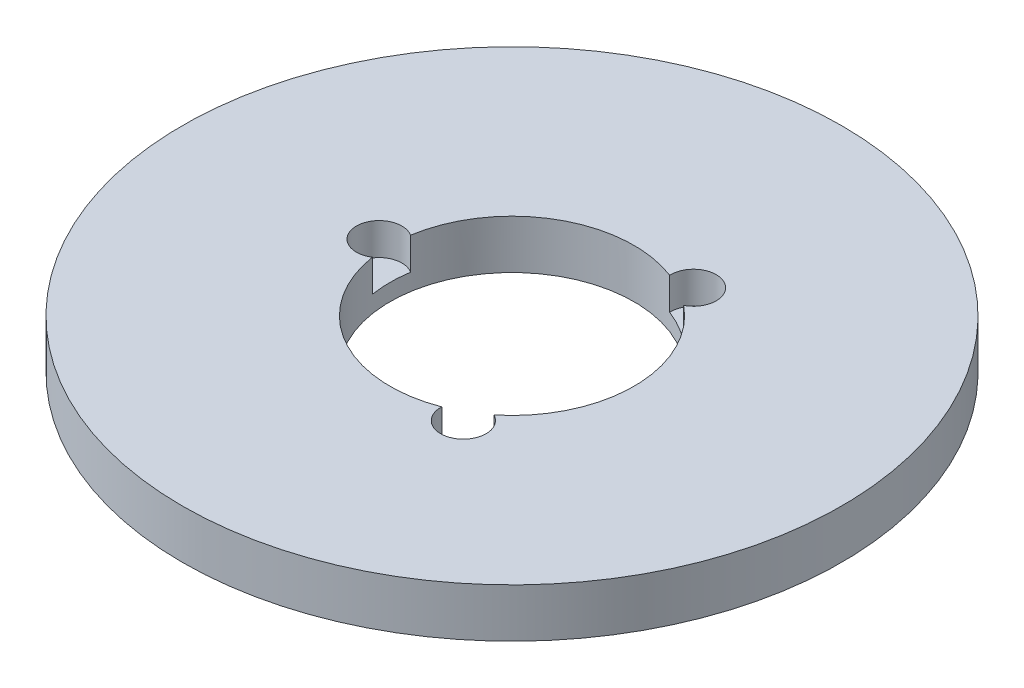
ISO-10303-21;
HEADER;
FILE_DESCRIPTION(('STEP AP214'),'2;1');
FILE_NAME('part.step','',(''),(''),'','','');
FILE_SCHEMA(('AUTOMOTIVE_DESIGN { 1 0 10303 214 1 1 1 1 }'));
ENDSEC;
DATA;
#1=APPLICATION_CONTEXT('core data for automotive mechanical design processes');
#2=APPLICATION_PROTOCOL_DEFINITION('international standard','automotive_design',2000,#1);
#3=PRODUCT_CONTEXT('',#1,'mechanical');
#4=PRODUCT('Part','Part','',(#3));
#5=PRODUCT_RELATED_PRODUCT_CATEGORY('part','',(#4));
#6=PRODUCT_DEFINITION_FORMATION('','',#4);
#7=PRODUCT_DEFINITION_CONTEXT('part definition',#1,'design');
#8=PRODUCT_DEFINITION('design','',#6,#7);
#9=PRODUCT_DEFINITION_SHAPE('','',#8);
#10=(LENGTH_UNIT() NAMED_UNIT(*) SI_UNIT(.MILLI.,.METRE.));
#11=(NAMED_UNIT(*) PLANE_ANGLE_UNIT() SI_UNIT($,.RADIAN.));
#12=(NAMED_UNIT(*) SI_UNIT($,.STERADIAN.) SOLID_ANGLE_UNIT());
#13=UNCERTAINTY_MEASURE_WITH_UNIT(LENGTH_MEASURE(1.E-05),#10,'distance_accuracy_value','');
#14=(GEOMETRIC_REPRESENTATION_CONTEXT(3) GLOBAL_UNCERTAINTY_ASSIGNED_CONTEXT((#13)) GLOBAL_UNIT_ASSIGNED_CONTEXT((#10,
#11,#12)) REPRESENTATION_CONTEXT('',''));
#15=CARTESIAN_POINT('',(0.,0.,0.));
#16=DIRECTION('',(0.,0.,1.));
#17=DIRECTION('',(1.,0.,0.));
#18=AXIS2_PLACEMENT_3D('',#15,#16,#17);
#19=CARTESIAN_POINT('',(0.,10.,0.));
#20=DIRECTION('',(0.,-1.,0.));
#21=DIRECTION('',(0.,0.,-1.));
#22=AXIS2_PLACEMENT_3D('',#19,#20,#21);
#23=CYLINDRICAL_SURFACE('',#22,67.5);
#24=CARTESIAN_POINT('',(0.,10.,0.));
#25=DIRECTION('',(0.,1.,0.));
#26=DIRECTION('',(0.,0.,1.));
#27=AXIS2_PLACEMENT_3D('',#24,#25,#26);
#28=CIRCLE('',#27,67.5);
#29=CARTESIAN_POINT('',(0.,10.,67.5));
#30=VERTEX_POINT('',#29);
#31=EDGE_CURVE('E126',#30,#30,#28,.T.);
#32=ORIENTED_EDGE('',*,*,#31,.F.);
#33=EDGE_LOOP('',(#32));
#34=FACE_BOUND('',#33,.T.);
#35=CARTESIAN_POINT('',(0.,0.,0.));
#36=DIRECTION('',(0.,1.,0.));
#37=DIRECTION('',(0.,0.,1.));
#38=AXIS2_PLACEMENT_3D('',#35,#36,#37);
#39=CIRCLE('',#38,67.5);
#40=CARTESIAN_POINT('',(0.,0.,67.5));
#41=VERTEX_POINT('',#40);
#42=EDGE_CURVE('E124',#41,#41,#39,.T.);
#43=ORIENTED_EDGE('',*,*,#42,.T.);
#44=EDGE_LOOP('',(#43));
#45=FACE_BOUND('',#44,.T.);
#46=ADVANCED_FACE('F39',(#34,#45),#23,.T.);
#47=CARTESIAN_POINT('',(0.,10.,0.));
#48=DIRECTION('',(0.,1.,0.));
#49=DIRECTION('',(0.,0.,1.));
#50=AXIS2_PLACEMENT_3D('',#47,#48,#49);
#51=PLANE('',#50);
#52=CARTESIAN_POINT('',(13.6070457408787,10.,23.5680945641154));
#53=DIRECTION('',(0.,1.,0.));
#54=DIRECTION('',(0.866025403784436,0.,-0.500000000000004));
#55=AXIS2_PLACEMENT_3D('',#52,#53,#54);
#56=CIRCLE('',#55,4.65427887099612);
#57=CARTESIAN_POINT('',(8.95836776458697,10.,23.3398296265078));
#58=VERTEX_POINT('',#57);
#59=CARTESIAN_POINT('',(15.7337014942631,10.,19.4280888738297));
#60=VERTEX_POINT('',#59);
#61=EDGE_CURVE('E147',#58,#60,#56,.T.);
#62=ORIENTED_EDGE('',*,*,#61,.F.);
#63=CARTESIAN_POINT('',(0.,10.,0.));
#64=DIRECTION('',(0.,1.,0.));
#65=DIRECTION('',(0.,0.,1.));
#66=AXIS2_PLACEMENT_3D('',#63,#64,#65);
#67=CIRCLE('',#66,25.);
#68=CARTESIAN_POINT('',(-24.6920692588498,10.,3.91174075267806));
#69=VERTEX_POINT('',#68);
#70=EDGE_CURVE('E118',#69,#58,#67,.T.);
#71=ORIENTED_EDGE('',*,*,#70,.F.);
#72=CARTESIAN_POINT('',(-27.2140914817572,10.,0.));
#73=DIRECTION('',(0.,1.,0.));
#74=DIRECTION('',(0.,0.,1.));
#75=AXIS2_PLACEMENT_3D('',#72,#73,#74);
#76=CIRCLE('',#75,4.65427887099612);
#77=CARTESIAN_POINT('',(-24.6920692588498,10.,-3.91174075267806));
#78=VERTEX_POINT('',#77);
#79=EDGE_CURVE('E113',#78,#69,#76,.T.);
#80=ORIENTED_EDGE('',*,*,#79,.F.);
#81=CARTESIAN_POINT('',(8.95836776458664,10.,-23.3398296265079));
#82=VERTEX_POINT('',#81);
#83=EDGE_CURVE('E106',#82,#78,#67,.T.);
#84=ORIENTED_EDGE('',*,*,#83,.F.);
#85=CARTESIAN_POINT('',(13.6070457408784,10.,-23.5680945641156));
#86=DIRECTION('',(0.,1.,0.));
#87=DIRECTION('',(-0.866025403784443,0.,-0.499999999999992));
#88=AXIS2_PLACEMENT_3D('',#85,#86,#87);
#89=CIRCLE('',#88,4.65427887099612);
#90=CARTESIAN_POINT('',(15.7337014942628,10.,-19.4280888738299));
#91=VERTEX_POINT('',#90);
#92=EDGE_CURVE('E90',#91,#82,#89,.T.);
#93=ORIENTED_EDGE('',*,*,#92,.F.);
#94=EDGE_CURVE('E116',#60,#91,#67,.T.);
#95=ORIENTED_EDGE('',*,*,#94,.F.);
#96=EDGE_LOOP('',(#62,#71,#80,#84,#93,#95));
#97=FACE_BOUND('',#96,.T.);
#98=ORIENTED_EDGE('',*,*,#31,.T.);
#99=EDGE_LOOP('',(#98));
#100=FACE_BOUND('',#99,.T.);
#101=ADVANCED_FACE('F115',(#97,#100),#51,.T.);
#102=CARTESIAN_POINT('',(0.,0.,0.));
#103=DIRECTION('',(0.,1.,0.));
#104=DIRECTION('',(0.,0.,1.));
#105=AXIS2_PLACEMENT_3D('',#102,#103,#104);
#106=PLANE('',#105);
#107=CARTESIAN_POINT('',(0.,0.,0.));
#108=DIRECTION('',(0.,1.,0.));
#109=DIRECTION('',(0.,0.,1.));
#110=AXIS2_PLACEMENT_3D('',#107,#108,#109);
#111=CIRCLE('',#110,25.);
#112=CARTESIAN_POINT('',(0.,0.,25.));
#113=VERTEX_POINT('',#112);
#114=EDGE_CURVE('E120',#113,#113,#111,.T.);
#115=ORIENTED_EDGE('',*,*,#114,.T.);
#116=EDGE_LOOP('',(#115));
#117=FACE_BOUND('',#116,.T.);
#118=ORIENTED_EDGE('',*,*,#42,.F.);
#119=EDGE_LOOP('',(#118));
#120=FACE_BOUND('',#119,.T.);
#121=ADVANCED_FACE('F164',(#117,#120),#106,.F.);
#122=CARTESIAN_POINT('',(0.,10.,0.));
#123=DIRECTION('',(0.,-1.,0.));
#124=DIRECTION('',(0.,0.,-1.));
#125=AXIS2_PLACEMENT_3D('',#122,#123,#124);
#126=CYLINDRICAL_SURFACE('',#125,25.);
#127=DIRECTION('',(0.,1.,0.));
#128=VECTOR('',#127,1.);
#129=CARTESIAN_POINT('',(8.95836776458697,6.71700690239391,23.3398296265078));
#130=LINE('',#129,#128);
#131=CARTESIAN_POINT('',(8.95836776458697,3.43401380478783,23.3398296265078));
#132=VERTEX_POINT('',#131);
#133=EDGE_CURVE('E11',#132,#58,#130,.T.);
#134=ORIENTED_EDGE('',*,*,#133,.F.);
#135=CARTESIAN_POINT('',(0.,3.43401380478783,0.));
#136=DIRECTION('',(0.,1.,0.));
#137=DIRECTION('',(0.,0.,1.));
#138=AXIS2_PLACEMENT_3D('',#135,#136,#137);
#139=CIRCLE('',#138,25.);
#140=CARTESIAN_POINT('',(15.7337014942631,3.43401380478783,19.4280888738297));
#141=VERTEX_POINT('',#140);
#142=EDGE_CURVE('E144',#132,#141,#139,.T.);
#143=ORIENTED_EDGE('',*,*,#142,.T.);
#144=DIRECTION('',(0.,1.,0.));
#145=VECTOR('',#144,1.);
#146=CARTESIAN_POINT('',(15.7337014942631,6.71700690239391,19.4280888738297));
#147=LINE('',#146,#145);
#148=EDGE_CURVE('E46',#60,#141,#147,.F.);
#149=ORIENTED_EDGE('',*,*,#148,.F.);
#150=ORIENTED_EDGE('',*,*,#94,.T.);
#151=DIRECTION('',(0.,1.,0.));
#152=VECTOR('',#151,1.);
#153=CARTESIAN_POINT('',(15.7337014942628,6.71700690239391,-19.4280888738299));
#154=LINE('',#153,#152);
#155=CARTESIAN_POINT('',(15.7337014942628,3.43401380478783,-19.4280888738299));
#156=VERTEX_POINT('',#155);
#157=EDGE_CURVE('E92',#156,#91,#154,.T.);
#158=ORIENTED_EDGE('',*,*,#157,.F.);
#159=CARTESIAN_POINT('',(0.,3.43401380478783,0.));
#160=DIRECTION('',(0.,1.,0.));
#161=DIRECTION('',(0.,0.,1.));
#162=AXIS2_PLACEMENT_3D('',#159,#160,#161);
#163=CIRCLE('',#162,25.);
#164=CARTESIAN_POINT('',(8.95836776458664,3.43401380478783,-23.3398296265079));
#165=VERTEX_POINT('',#164);
#166=EDGE_CURVE('E107',#156,#165,#163,.T.);
#167=ORIENTED_EDGE('',*,*,#166,.T.);
#168=DIRECTION('',(0.,1.,0.));
#169=VECTOR('',#168,1.);
#170=CARTESIAN_POINT('',(8.95836776458664,6.71700690239391,-23.3398296265079));
#171=LINE('',#170,#169);
#172=EDGE_CURVE('E95',#82,#165,#171,.F.);
#173=ORIENTED_EDGE('',*,*,#172,.F.);
#174=ORIENTED_EDGE('',*,*,#83,.T.);
#175=DIRECTION('',(0.,1.,0.));
#176=VECTOR('',#175,1.);
#177=CARTESIAN_POINT('',(-24.6920692588499,6.71700690239391,-3.91174075267807));
#178=LINE('',#177,#176);
#179=CARTESIAN_POINT('',(-24.6920692588498,3.43401380478783,-3.91174075267806));
#180=VERTEX_POINT('',#179);
#181=EDGE_CURVE('E143',#180,#78,#178,.T.);
#182=ORIENTED_EDGE('',*,*,#181,.F.);
#183=CARTESIAN_POINT('',(0.,3.43401380478783,0.));
#184=DIRECTION('',(0.,1.,0.));
#185=DIRECTION('',(0.,0.,1.));
#186=AXIS2_PLACEMENT_3D('',#183,#184,#185);
#187=CIRCLE('',#186,25.);
#188=CARTESIAN_POINT('',(-24.6920692588498,3.43401380478783,3.91174075267806));
#189=VERTEX_POINT('',#188);
#190=EDGE_CURVE('E132',#180,#189,#187,.T.);
#191=ORIENTED_EDGE('',*,*,#190,.T.);
#192=DIRECTION('',(0.,1.,0.));
#193=VECTOR('',#192,1.);
#194=CARTESIAN_POINT('',(-24.6920692588499,6.71700690239391,3.91174075267807));
#195=LINE('',#194,#193);
#196=EDGE_CURVE('E137',#69,#189,#195,.F.);
#197=ORIENTED_EDGE('',*,*,#196,.F.);
#198=ORIENTED_EDGE('',*,*,#70,.T.);
#199=EDGE_LOOP('',(#134,#143,#149,#150,#158,#167,#173,#174,#182,#191,#197,#198));
#200=FACE_BOUND('',#199,.T.);
#201=ORIENTED_EDGE('',*,*,#114,.F.);
#202=EDGE_LOOP('',(#201));
#203=FACE_BOUND('',#202,.T.);
#204=ADVANCED_FACE('F103',(#200,#203),#126,.F.);
#205=CARTESIAN_POINT('',(-27.2140914817572,3.43401380478783,0.));
#206=DIRECTION('',(0.,1.,0.));
#207=DIRECTION('',(0.,0.,1.));
#208=AXIS2_PLACEMENT_3D('',#205,#206,#207);
#209=CYLINDRICAL_SURFACE('',#208,4.65427887099612);
#210=ORIENTED_EDGE('',*,*,#181,.T.);
#211=ORIENTED_EDGE('',*,*,#79,.T.);
#212=ORIENTED_EDGE('',*,*,#196,.T.);
#213=CARTESIAN_POINT('',(-27.2140914817572,3.43401380478783,0.));
#214=DIRECTION('',(0.,1.,0.));
#215=DIRECTION('',(0.,0.,1.));
#216=AXIS2_PLACEMENT_3D('',#213,#214,#215);
#217=CIRCLE('',#216,4.65427887099612);
#218=EDGE_CURVE('E121',#180,#189,#217,.T.);
#219=ORIENTED_EDGE('',*,*,#218,.F.);
#220=EDGE_LOOP('',(#210,#211,#212,#219));
#221=FACE_BOUND('',#220,.T.);
#222=ADVANCED_FACE('F174',(#221),#209,.F.);
#223=CARTESIAN_POINT('',(-27.2140914817572,3.43401380478783,0.));
#224=DIRECTION('',(0.,1.,0.));
#225=DIRECTION('',(0.,0.,1.));
#226=AXIS2_PLACEMENT_3D('',#223,#224,#225);
#227=PLANE('',#226);
#228=ORIENTED_EDGE('',*,*,#218,.T.);
#229=ORIENTED_EDGE('',*,*,#190,.F.);
#230=EDGE_LOOP('',(#228,#229));
#231=FACE_BOUND('',#230,.T.);
#232=ADVANCED_FACE('F177',(#231),#227,.T.);
#233=CARTESIAN_POINT('',(13.6070457408784,3.43401380478783,-23.5680945641156));
#234=DIRECTION('',(0.,1.,0.));
#235=DIRECTION('',(0.,0.,1.));
#236=AXIS2_PLACEMENT_3D('',#233,#234,#235);
#237=CYLINDRICAL_SURFACE('',#236,4.65427887099612);
#238=ORIENTED_EDGE('',*,*,#157,.T.);
#239=ORIENTED_EDGE('',*,*,#92,.T.);
#240=ORIENTED_EDGE('',*,*,#172,.T.);
#241=CARTESIAN_POINT('',(13.6070457408784,3.43401380478783,-23.5680945641156));
#242=DIRECTION('',(0.,1.,0.));
#243=DIRECTION('',(-0.866025403784443,0.,-0.499999999999992));
#244=AXIS2_PLACEMENT_3D('',#241,#242,#243);
#245=CIRCLE('',#244,4.65427887099612);
#246=EDGE_CURVE('E56',#156,#165,#245,.T.);
#247=ORIENTED_EDGE('',*,*,#246,.F.);
#248=EDGE_LOOP('',(#238,#239,#240,#247));
#249=FACE_BOUND('',#248,.T.);
#250=ADVANCED_FACE('F93',(#249),#237,.F.);
#251=CARTESIAN_POINT('',(13.6070457408784,3.43401380478783,-23.5680945641156));
#252=DIRECTION('',(0.,1.,0.));
#253=DIRECTION('',(-0.866025403784443,0.,-0.499999999999992));
#254=AXIS2_PLACEMENT_3D('',#251,#252,#253);
#255=PLANE('',#254);
#256=ORIENTED_EDGE('',*,*,#246,.T.);
#257=ORIENTED_EDGE('',*,*,#166,.F.);
#258=EDGE_LOOP('',(#256,#257));
#259=FACE_BOUND('',#258,.T.);
#260=ADVANCED_FACE('F160',(#259),#255,.T.);
#261=CARTESIAN_POINT('',(13.6070457408787,3.43401380478783,23.5680945641154));
#262=DIRECTION('',(0.,1.,0.));
#263=DIRECTION('',(0.,0.,1.));
#264=AXIS2_PLACEMENT_3D('',#261,#262,#263);
#265=CYLINDRICAL_SURFACE('',#264,4.65427887099612);
#266=ORIENTED_EDGE('',*,*,#133,.T.);
#267=ORIENTED_EDGE('',*,*,#61,.T.);
#268=ORIENTED_EDGE('',*,*,#148,.T.);
#269=CARTESIAN_POINT('',(13.6070457408787,3.43401380478783,23.5680945641154));
#270=DIRECTION('',(0.,1.,0.));
#271=DIRECTION('',(0.866025403784436,0.,-0.500000000000004));
#272=AXIS2_PLACEMENT_3D('',#269,#270,#271);
#273=CIRCLE('',#272,4.65427887099612);
#274=EDGE_CURVE('E55',#132,#141,#273,.T.);
#275=ORIENTED_EDGE('',*,*,#274,.F.);
#276=EDGE_LOOP('',(#266,#267,#268,#275));
#277=FACE_BOUND('',#276,.T.);
#278=ADVANCED_FACE('F149',(#277),#265,.F.);
#279=CARTESIAN_POINT('',(13.6070457408787,3.43401380478783,23.5680945641154));
#280=DIRECTION('',(0.,1.,0.));
#281=DIRECTION('',(0.866025403784436,0.,-0.500000000000004));
#282=AXIS2_PLACEMENT_3D('',#279,#280,#281);
#283=PLANE('',#282);
#284=ORIENTED_EDGE('',*,*,#274,.T.);
#285=ORIENTED_EDGE('',*,*,#142,.F.);
#286=EDGE_LOOP('',(#284,#285));
#287=FACE_BOUND('',#286,.T.);
#288=ADVANCED_FACE('F151',(#287),#283,.T.);
#289=CLOSED_SHELL('',(#46,#101,#121,#204,#222,#232,#250,#260,#278,#288));
#290=MANIFOLD_SOLID_BREP('B2',#289);
#291=ADVANCED_BREP_SHAPE_REPRESENTATION('',(#18,#290),#14);
#292=SHAPE_DEFINITION_REPRESENTATION(#9,#291);
ENDSEC;
END-ISO-10303-21;
